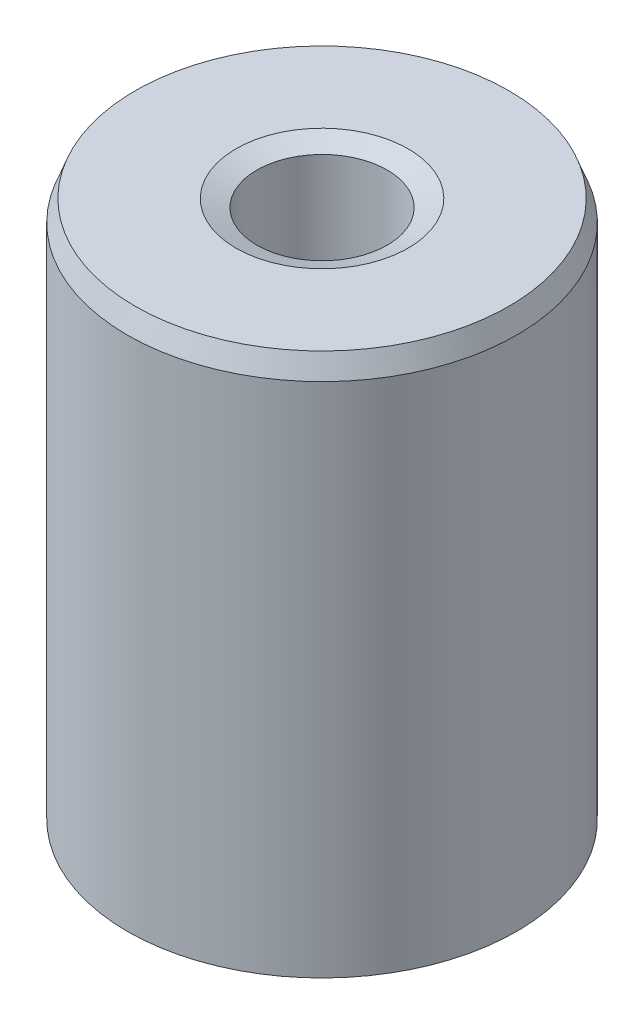
ISO-10303-21;
HEADER;
FILE_DESCRIPTION(('STEP AP214'),'2;1');
FILE_NAME('part.step','',(''),(''),'','','');
FILE_SCHEMA(('AUTOMOTIVE_DESIGN { 1 0 10303 214 1 1 1 1 }'));
ENDSEC;
DATA;
#1=APPLICATION_CONTEXT('core data for automotive mechanical design processes');
#2=APPLICATION_PROTOCOL_DEFINITION('international standard','automotive_design',2000,#1);
#3=PRODUCT_CONTEXT('',#1,'mechanical');
#4=PRODUCT('Part','Part','',(#3));
#5=PRODUCT_RELATED_PRODUCT_CATEGORY('part','',(#4));
#6=PRODUCT_DEFINITION_FORMATION('','',#4);
#7=PRODUCT_DEFINITION_CONTEXT('part definition',#1,'design');
#8=PRODUCT_DEFINITION('design','',#6,#7);
#9=PRODUCT_DEFINITION_SHAPE('','',#8);
#10=(LENGTH_UNIT() NAMED_UNIT(*) SI_UNIT(.MILLI.,.METRE.));
#11=(NAMED_UNIT(*) PLANE_ANGLE_UNIT() SI_UNIT($,.RADIAN.));
#12=(NAMED_UNIT(*) SI_UNIT($,.STERADIAN.) SOLID_ANGLE_UNIT());
#13=UNCERTAINTY_MEASURE_WITH_UNIT(LENGTH_MEASURE(1.E-05),#10,'distance_accuracy_value','');
#14=(GEOMETRIC_REPRESENTATION_CONTEXT(3) GLOBAL_UNCERTAINTY_ASSIGNED_CONTEXT((#13)) GLOBAL_UNIT_ASSIGNED_CONTEXT((#10,
#11,#12)) REPRESENTATION_CONTEXT('',''));
#15=CARTESIAN_POINT('',(0.,0.,0.));
#16=DIRECTION('',(0.,0.,1.));
#17=DIRECTION('',(1.,0.,0.));
#18=AXIS2_PLACEMENT_3D('',#15,#16,#17);
#19=CARTESIAN_POINT('',(0.,28.0080821815336,0.));
#20=DIRECTION('',(0.,-1.,0.));
#21=DIRECTION('',(0.,0.,-1.));
#22=AXIS2_PLACEMENT_3D('',#19,#20,#21);
#23=CYLINDRICAL_SURFACE('',#22,10.);
#24=CARTESIAN_POINT('',(0.,0.405718925415726,0.));
#25=DIRECTION('',(0.,1.,0.));
#26=DIRECTION('',(0.,0.,1.));
#27=AXIS2_PLACEMENT_3D('',#24,#25,#26);
#28=CIRCLE('',#27,10.);
#29=CARTESIAN_POINT('',(0.,0.405718925415726,10.));
#30=VERTEX_POINT('',#29);
#31=EDGE_CURVE('E10',#30,#30,#28,.T.);
#32=ORIENTED_EDGE('',*,*,#31,.T.);
#33=EDGE_LOOP('',(#32));
#34=FACE_BOUND('',#33,.T.);
#35=CARTESIAN_POINT('',(0.,26.9316751928464,0.));
#36=DIRECTION('',(0.,1.,0.));
#37=DIRECTION('',(0.,0.,1.));
#38=AXIS2_PLACEMENT_3D('',#35,#36,#37);
#39=CIRCLE('',#38,10.);
#40=CARTESIAN_POINT('',(0.,26.9316751928464,10.));
#41=VERTEX_POINT('',#40);
#42=EDGE_CURVE('E50',#41,#41,#39,.F.);
#43=ORIENTED_EDGE('',*,*,#42,.T.);
#44=EDGE_LOOP('',(#43));
#45=FACE_BOUND('',#44,.T.);
#46=ADVANCED_FACE('F39',(#34,#45),#23,.T.);
#47=CARTESIAN_POINT('',(0.,28.0080821815336,0.));
#48=DIRECTION('',(0.,1.,0.));
#49=DIRECTION('',(0.,0.,1.));
#50=AXIS2_PLACEMENT_3D('',#47,#48,#49);
#51=PLANE('',#50);
#52=CARTESIAN_POINT('',(0.,28.0080821815336,0.));
#53=DIRECTION('',(0.,1.,0.));
#54=DIRECTION('',(0.,0.,1.));
#55=AXIS2_PLACEMENT_3D('',#52,#53,#54);
#56=CIRCLE('',#55,4.42274070893184);
#57=CARTESIAN_POINT('',(0.,28.0080821815336,4.42274070893184));
#58=VERTEX_POINT('',#57);
#59=EDGE_CURVE('E58',#58,#58,#56,.F.);
#60=ORIENTED_EDGE('',*,*,#59,.T.);
#61=EDGE_LOOP('',(#60));
#62=FACE_BOUND('',#61,.T.);
#63=CARTESIAN_POINT('',(0.,28.0080821815336,0.));
#64=DIRECTION('',(0.,1.,0.));
#65=DIRECTION('',(0.,0.,1.));
#66=AXIS2_PLACEMENT_3D('',#63,#64,#65);
#67=CIRCLE('',#66,9.59428107458427);
#68=CARTESIAN_POINT('',(0.,28.0080821815336,9.59428107458427));
#69=VERTEX_POINT('',#68);
#70=EDGE_CURVE('E61',#69,#69,#67,.T.);
#71=ORIENTED_EDGE('',*,*,#70,.T.);
#72=EDGE_LOOP('',(#71));
#73=FACE_BOUND('',#72,.T.);
#74=ADVANCED_FACE('F88',(#62,#73),#51,.T.);
#75=CARTESIAN_POINT('',(0.,0.,0.));
#76=DIRECTION('',(0.,1.,0.));
#77=DIRECTION('',(0.,0.,1.));
#78=AXIS2_PLACEMENT_3D('',#75,#76,#77);
#79=PLANE('',#78);
#80=CARTESIAN_POINT('',(0.,0.,0.));
#81=DIRECTION('',(0.,1.,0.));
#82=DIRECTION('',(0.,0.,1.));
#83=AXIS2_PLACEMENT_3D('',#80,#81,#82);
#84=CIRCLE('',#83,3.75205264566041);
#85=CARTESIAN_POINT('',(0.,0.,3.75205264566041));
#86=VERTEX_POINT('',#85);
#87=EDGE_CURVE('E51',#86,#86,#84,.T.);
#88=ORIENTED_EDGE('',*,*,#87,.T.);
#89=EDGE_LOOP('',(#88));
#90=FACE_BOUND('',#89,.T.);
#91=CARTESIAN_POINT('',(0.,0.,0.));
#92=DIRECTION('',(0.,1.,0.));
#93=DIRECTION('',(0.,0.,1.));
#94=AXIS2_PLACEMENT_3D('',#91,#92,#93);
#95=CIRCLE('',#94,8.92359301131285);
#96=CARTESIAN_POINT('',(0.,0.,8.92359301131285));
#97=VERTEX_POINT('',#96);
#98=EDGE_CURVE('E54',#97,#97,#95,.F.);
#99=ORIENTED_EDGE('',*,*,#98,.T.);
#100=EDGE_LOOP('',(#99));
#101=FACE_BOUND('',#100,.T.);
#102=ADVANCED_FACE('F83',(#90,#101),#79,.F.);
#103=CARTESIAN_POINT('',(0.,28.0080821815336,0.));
#104=DIRECTION('',(0.,-1.,0.));
#105=DIRECTION('',(0.,0.,-1.));
#106=AXIS2_PLACEMENT_3D('',#103,#104,#105);
#107=CYLINDRICAL_SURFACE('',#106,3.34633372024469);
#108=CARTESIAN_POINT('',(0.,27.6023632561179,0.));
#109=DIRECTION('',(0.,1.,0.));
#110=DIRECTION('',(0.,0.,1.));
#111=AXIS2_PLACEMENT_3D('',#108,#109,#110);
#112=CIRCLE('',#111,3.34633372024469);
#113=CARTESIAN_POINT('',(0.,27.6023632561179,3.34633372024469));
#114=VERTEX_POINT('',#113);
#115=EDGE_CURVE('E67',#114,#114,#112,.T.);
#116=ORIENTED_EDGE('',*,*,#115,.T.);
#117=EDGE_LOOP('',(#116));
#118=FACE_BOUND('',#117,.T.);
#119=CARTESIAN_POINT('',(0.,1.07640698868715,0.));
#120=DIRECTION('',(0.,1.,0.));
#121=DIRECTION('',(0.,0.,1.));
#122=AXIS2_PLACEMENT_3D('',#119,#120,#121);
#123=CIRCLE('',#122,3.34633372024469);
#124=CARTESIAN_POINT('',(0.,1.07640698868715,3.34633372024469));
#125=VERTEX_POINT('',#124);
#126=EDGE_CURVE('E69',#125,#125,#123,.F.);
#127=ORIENTED_EDGE('',*,*,#126,.T.);
#128=EDGE_LOOP('',(#127));
#129=FACE_BOUND('',#128,.T.);
#130=ADVANCED_FACE('F71',(#118,#129),#107,.F.);
#131=CARTESIAN_POINT('',(0.,27.6023632561179,0.));
#132=DIRECTION('',(0.,1.,0.));
#133=DIRECTION('',(0.,0.,1.));
#134=AXIS2_PLACEMENT_3D('',#131,#132,#133);
#135=CONICAL_SURFACE('',#134,3.34633372024469,1.21034375506111);
#136=ORIENTED_EDGE('',*,*,#59,.F.);
#137=EDGE_LOOP('',(#136));
#138=FACE_BOUND('',#137,.T.);
#139=ORIENTED_EDGE('',*,*,#115,.F.);
#140=EDGE_LOOP('',(#139));
#141=FACE_BOUND('',#140,.T.);
#142=ADVANCED_FACE('F77',(#138,#141),#135,.F.);
#143=CARTESIAN_POINT('',(0.,0.,0.));
#144=DIRECTION('',(0.,-1.,0.));
#145=DIRECTION('',(0.,0.,-1.));
#146=AXIS2_PLACEMENT_3D('',#143,#144,#145);
#147=CONICAL_SURFACE('',#146,3.75205264566041,0.360452571733792);
#148=ORIENTED_EDGE('',*,*,#126,.F.);
#149=EDGE_LOOP('',(#148));
#150=FACE_BOUND('',#149,.T.);
#151=ORIENTED_EDGE('',*,*,#87,.F.);
#152=EDGE_LOOP('',(#151));
#153=FACE_BOUND('',#152,.T.);
#154=ADVANCED_FACE('F73',(#150,#153),#147,.F.);
#155=CARTESIAN_POINT('',(0.,0.405718925415726,0.));
#156=DIRECTION('',(0.,1.,0.));
#157=DIRECTION('',(0.,0.,1.));
#158=AXIS2_PLACEMENT_3D('',#155,#156,#157);
#159=CONICAL_SURFACE('',#158,10.,1.2103437550611);
#160=ORIENTED_EDGE('',*,*,#98,.F.);
#161=EDGE_LOOP('',(#160));
#162=FACE_BOUND('',#161,.T.);
#163=ORIENTED_EDGE('',*,*,#31,.F.);
#164=EDGE_LOOP('',(#163));
#165=FACE_BOUND('',#164,.T.);
#166=ADVANCED_FACE('F76',(#162,#165),#159,.T.);
#167=CARTESIAN_POINT('',(0.,28.0080821815336,0.));
#168=DIRECTION('',(0.,-1.,0.));
#169=DIRECTION('',(0.,0.,-1.));
#170=AXIS2_PLACEMENT_3D('',#167,#168,#169);
#171=CONICAL_SURFACE('',#170,9.59428107458427,0.360452571733794);
#172=ORIENTED_EDGE('',*,*,#42,.F.);
#173=EDGE_LOOP('',(#172));
#174=FACE_BOUND('',#173,.T.);
#175=ORIENTED_EDGE('',*,*,#70,.F.);
#176=EDGE_LOOP('',(#175));
#177=FACE_BOUND('',#176,.T.);
#178=ADVANCED_FACE('F45',(#174,#177),#171,.T.);
#179=CLOSED_SHELL('',(#46,#74,#102,#130,#142,#154,#166,#178));
#180=MANIFOLD_SOLID_BREP('B2',#179);
#181=ADVANCED_BREP_SHAPE_REPRESENTATION('',(#18,#180),#14);
#182=SHAPE_DEFINITION_REPRESENTATION(#9,#181);
ENDSEC;
END-ISO-10303-21;
